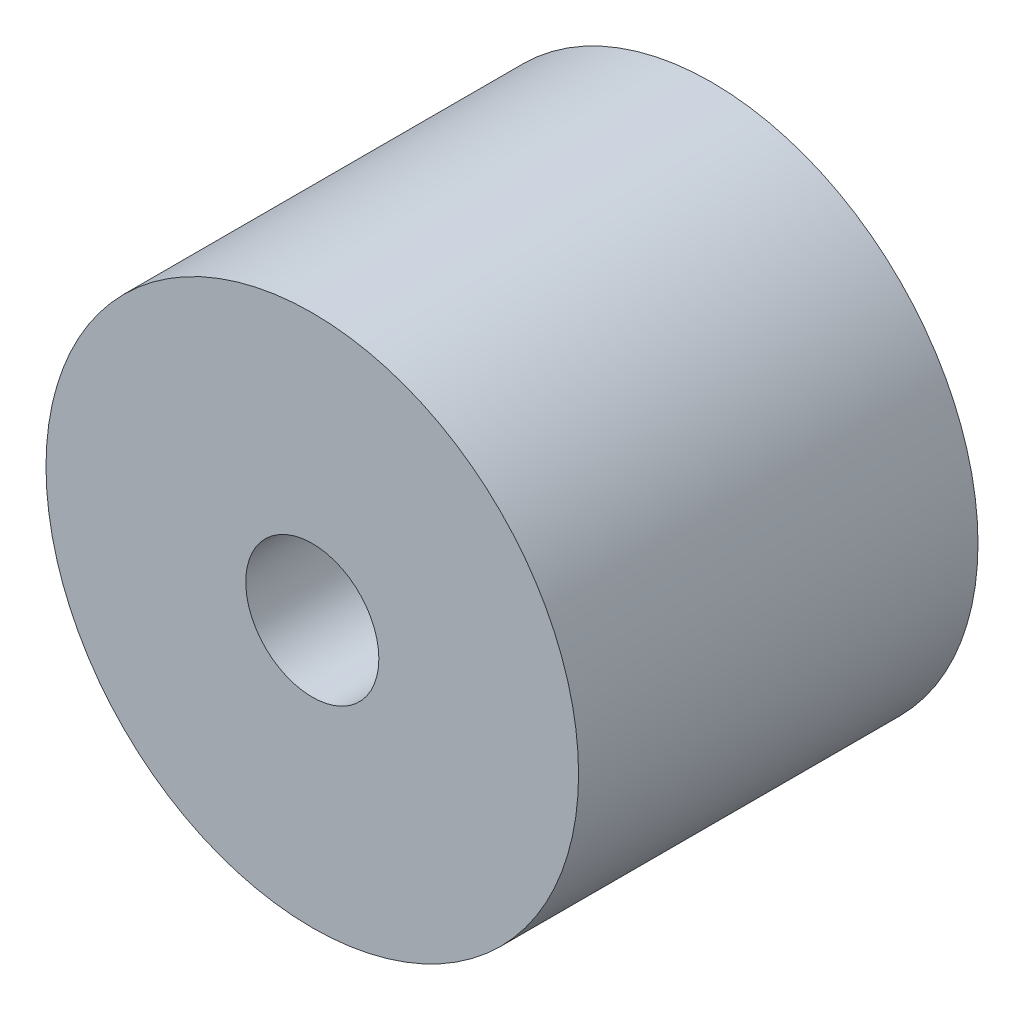
ISO-10303-21;
HEADER;
FILE_DESCRIPTION(('STEP AP214'),'2;1');
FILE_NAME('part.step','',(''),(''),'','','');
FILE_SCHEMA(('AUTOMOTIVE_DESIGN { 1 0 10303 214 1 1 1 1 }'));
ENDSEC;
DATA;
#1=APPLICATION_CONTEXT('core data for automotive mechanical design processes');
#2=APPLICATION_PROTOCOL_DEFINITION('international standard','automotive_design',2000,#1);
#3=PRODUCT_CONTEXT('',#1,'mechanical');
#4=PRODUCT('Part','Part','',(#3));
#5=PRODUCT_RELATED_PRODUCT_CATEGORY('part','',(#4));
#6=PRODUCT_DEFINITION_FORMATION('','',#4);
#7=PRODUCT_DEFINITION_CONTEXT('part definition',#1,'design');
#8=PRODUCT_DEFINITION('design','',#6,#7);
#9=PRODUCT_DEFINITION_SHAPE('','',#8);
#10=(LENGTH_UNIT() NAMED_UNIT(*) SI_UNIT(.MILLI.,.METRE.));
#11=(NAMED_UNIT(*) PLANE_ANGLE_UNIT() SI_UNIT($,.RADIAN.));
#12=(NAMED_UNIT(*) SI_UNIT($,.STERADIAN.) SOLID_ANGLE_UNIT());
#13=UNCERTAINTY_MEASURE_WITH_UNIT(LENGTH_MEASURE(1.E-05),#10,'distance_accuracy_value','');
#14=(GEOMETRIC_REPRESENTATION_CONTEXT(3) GLOBAL_UNCERTAINTY_ASSIGNED_CONTEXT((#13)) GLOBAL_UNIT_ASSIGNED_CONTEXT((#10,
#11,#12)) REPRESENTATION_CONTEXT('',''));
#15=CARTESIAN_POINT('',(0.,0.,0.));
#16=DIRECTION('',(0.,0.,1.));
#17=DIRECTION('',(1.,0.,0.));
#18=AXIS2_PLACEMENT_3D('',#15,#16,#17);
#19=CARTESIAN_POINT('',(0.,0.,4.7625));
#20=DIRECTION('',(0.,0.,1.));
#21=DIRECTION('',(1.,0.,0.));
#22=AXIS2_PLACEMENT_3D('',#19,#20,#21);
#23=PLANE('',#22);
#24=CARTESIAN_POINT('',(0.,0.,4.7625));
#25=DIRECTION('',(0.,0.,1.));
#26=DIRECTION('',(1.,0.,0.));
#27=AXIS2_PLACEMENT_3D('',#24,#25,#26);
#28=CIRCLE('',#27,3.175);
#29=CARTESIAN_POINT('',(3.175,0.,4.7625));
#30=VERTEX_POINT('',#29);
#31=EDGE_CURVE('E10',#30,#30,#28,.T.);
#32=ORIENTED_EDGE('',*,*,#31,.T.);
#33=EDGE_LOOP('',(#32));
#34=FACE_BOUND('',#33,.T.);
#35=CARTESIAN_POINT('',(0.,0.,4.7625));
#36=DIRECTION('',(0.,0.,1.));
#37=DIRECTION('',(1.,0.,0.));
#38=AXIS2_PLACEMENT_3D('',#35,#36,#37);
#39=CIRCLE('',#38,0.79375);
#40=CARTESIAN_POINT('',(0.79375,0.,4.7625));
#41=VERTEX_POINT('',#40);
#42=EDGE_CURVE('E43',#41,#41,#39,.T.);
#43=ORIENTED_EDGE('',*,*,#42,.F.);
#44=EDGE_LOOP('',(#43));
#45=FACE_BOUND('',#44,.T.);
#46=ADVANCED_FACE('F32',(#34,#45),#23,.T.);
#47=CARTESIAN_POINT('',(0.,0.,0.));
#48=DIRECTION('',(0.,0.,1.));
#49=DIRECTION('',(1.,0.,0.));
#50=AXIS2_PLACEMENT_3D('',#47,#48,#49);
#51=PLANE('',#50);
#52=CARTESIAN_POINT('',(0.,0.,0.));
#53=DIRECTION('',(0.,0.,1.));
#54=DIRECTION('',(1.,0.,0.));
#55=AXIS2_PLACEMENT_3D('',#52,#53,#54);
#56=CIRCLE('',#55,3.175);
#57=CARTESIAN_POINT('',(3.175,0.,0.));
#58=VERTEX_POINT('',#57);
#59=EDGE_CURVE('E36',#58,#58,#56,.T.);
#60=ORIENTED_EDGE('',*,*,#59,.F.);
#61=EDGE_LOOP('',(#60));
#62=FACE_BOUND('',#61,.T.);
#63=CARTESIAN_POINT('',(0.,0.,0.));
#64=DIRECTION('',(0.,0.,1.));
#65=DIRECTION('',(1.,0.,0.));
#66=AXIS2_PLACEMENT_3D('',#63,#64,#65);
#67=CIRCLE('',#66,0.79375);
#68=CARTESIAN_POINT('',(0.79375,0.,0.));
#69=VERTEX_POINT('',#68);
#70=EDGE_CURVE('E45',#69,#69,#67,.T.);
#71=ORIENTED_EDGE('',*,*,#70,.T.);
#72=EDGE_LOOP('',(#71));
#73=FACE_BOUND('',#72,.T.);
#74=ADVANCED_FACE('F55',(#62,#73),#51,.F.);
#75=CARTESIAN_POINT('',(0.,0.,4.7625));
#76=DIRECTION('',(0.,0.,-1.));
#77=DIRECTION('',(-1.,0.,0.));
#78=AXIS2_PLACEMENT_3D('',#75,#76,#77);
#79=CYLINDRICAL_SURFACE('',#78,3.175);
#80=ORIENTED_EDGE('',*,*,#31,.F.);
#81=EDGE_LOOP('',(#80));
#82=FACE_BOUND('',#81,.T.);
#83=ORIENTED_EDGE('',*,*,#59,.T.);
#84=EDGE_LOOP('',(#83));
#85=FACE_BOUND('',#84,.T.);
#86=ADVANCED_FACE('F34',(#82,#85),#79,.T.);
#87=CARTESIAN_POINT('',(0.,0.,4.7625));
#88=DIRECTION('',(0.,0.,-1.));
#89=DIRECTION('',(-1.,0.,0.));
#90=AXIS2_PLACEMENT_3D('',#87,#88,#89);
#91=CYLINDRICAL_SURFACE('',#90,0.79375);
#92=ORIENTED_EDGE('',*,*,#42,.T.);
#93=EDGE_LOOP('',(#92));
#94=FACE_BOUND('',#93,.T.);
#95=ORIENTED_EDGE('',*,*,#70,.F.);
#96=EDGE_LOOP('',(#95));
#97=FACE_BOUND('',#96,.T.);
#98=ADVANCED_FACE('F51',(#94,#97),#91,.F.);
#99=CLOSED_SHELL('',(#46,#74,#86,#98));
#100=MANIFOLD_SOLID_BREP('B2',#99);
#101=ADVANCED_BREP_SHAPE_REPRESENTATION('',(#18,#100),#14);
#102=SHAPE_DEFINITION_REPRESENTATION(#9,#101);
ENDSEC;
END-ISO-10303-21;
